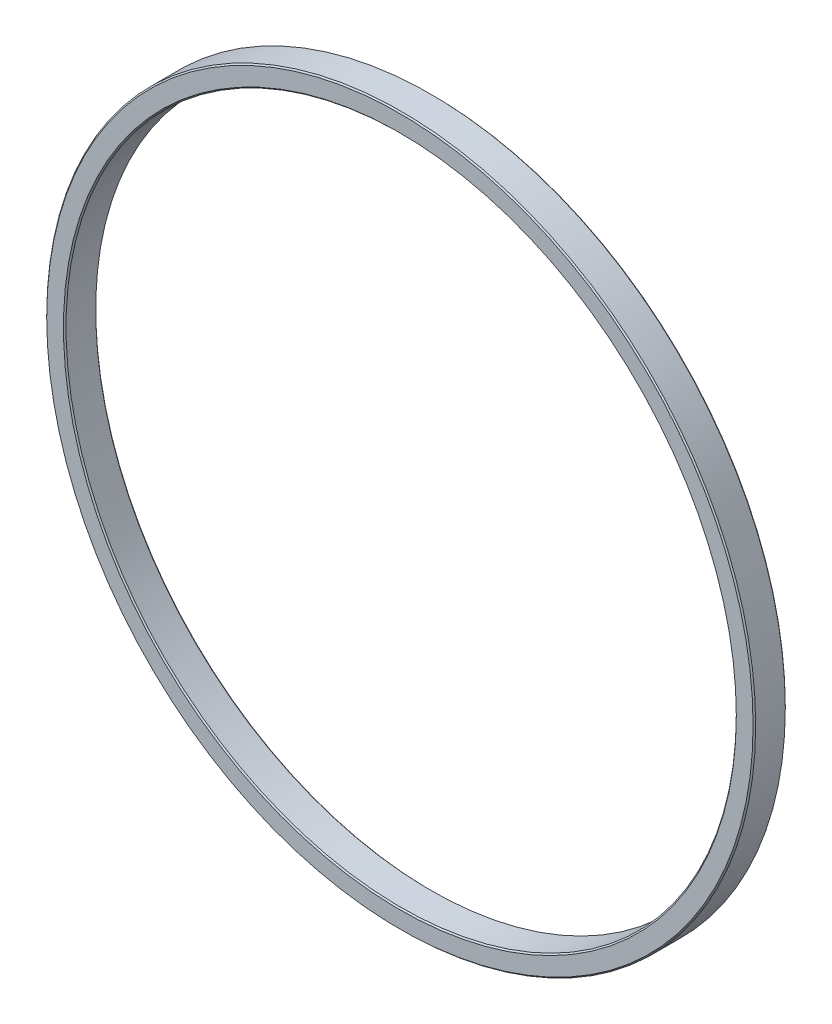
ISO-10303-21;
HEADER;
FILE_DESCRIPTION(('STEP AP214'),'2;1');
FILE_NAME('part.step','',(''),(''),'','','');
FILE_SCHEMA(('AUTOMOTIVE_DESIGN { 1 0 10303 214 1 1 1 1 }'));
ENDSEC;
DATA;
#1=APPLICATION_CONTEXT('core data for automotive mechanical design processes');
#2=APPLICATION_PROTOCOL_DEFINITION('international standard','automotive_design',2000,#1);
#3=PRODUCT_CONTEXT('',#1,'mechanical');
#4=PRODUCT('Part','Part','',(#3));
#5=PRODUCT_RELATED_PRODUCT_CATEGORY('part','',(#4));
#6=PRODUCT_DEFINITION_FORMATION('','',#4);
#7=PRODUCT_DEFINITION_CONTEXT('part definition',#1,'design');
#8=PRODUCT_DEFINITION('design','',#6,#7);
#9=PRODUCT_DEFINITION_SHAPE('','',#8);
#10=(LENGTH_UNIT() NAMED_UNIT(*) SI_UNIT(.MILLI.,.METRE.));
#11=(NAMED_UNIT(*) PLANE_ANGLE_UNIT() SI_UNIT($,.RADIAN.));
#12=(NAMED_UNIT(*) SI_UNIT($,.STERADIAN.) SOLID_ANGLE_UNIT());
#13=UNCERTAINTY_MEASURE_WITH_UNIT(LENGTH_MEASURE(1.E-05),#10,'distance_accuracy_value','');
#14=(GEOMETRIC_REPRESENTATION_CONTEXT(3) GLOBAL_UNCERTAINTY_ASSIGNED_CONTEXT((#13)) GLOBAL_UNIT_ASSIGNED_CONTEXT((#10,
#11,#12)) REPRESENTATION_CONTEXT('',''));
#15=CARTESIAN_POINT('',(0.,0.,0.));
#16=DIRECTION('',(0.,0.,1.));
#17=DIRECTION('',(1.,0.,0.));
#18=AXIS2_PLACEMENT_3D('',#15,#16,#17);
#19=CARTESIAN_POINT('',(0.,0.,5.));
#20=DIRECTION('',(0.,0.,1.));
#21=DIRECTION('',(1.,0.,0.));
#22=AXIS2_PLACEMENT_3D('',#19,#20,#21);
#23=PLANE('',#22);
#24=CARTESIAN_POINT('',(0.,0.,5.));
#25=DIRECTION('',(0.,0.,1.));
#26=DIRECTION('',(1.,0.,0.));
#27=AXIS2_PLACEMENT_3D('',#24,#25,#26);
#28=CIRCLE('',#27,52.2);
#29=CARTESIAN_POINT('',(52.2,0.,5.));
#30=VERTEX_POINT('',#29);
#31=EDGE_CURVE('E64',#30,#30,#28,.F.);
#32=ORIENTED_EDGE('',*,*,#31,.T.);
#33=EDGE_LOOP('',(#32));
#34=FACE_BOUND('',#33,.T.);
#35=CARTESIAN_POINT('',(0.,0.,5.));
#36=DIRECTION('',(0.,0.,1.));
#37=DIRECTION('',(1.,0.,0.));
#38=AXIS2_PLACEMENT_3D('',#35,#36,#37);
#39=CIRCLE('',#38,54.8);
#40=CARTESIAN_POINT('',(54.8,0.,5.));
#41=VERTEX_POINT('',#40);
#42=EDGE_CURVE('E68',#41,#41,#39,.T.);
#43=ORIENTED_EDGE('',*,*,#42,.T.);
#44=EDGE_LOOP('',(#43));
#45=FACE_BOUND('',#44,.T.);
#46=ADVANCED_FACE('F39',(#34,#45),#23,.T.);
#47=CARTESIAN_POINT('',(0.,0.,0.));
#48=DIRECTION('',(0.,0.,1.));
#49=DIRECTION('',(1.,0.,0.));
#50=AXIS2_PLACEMENT_3D('',#47,#48,#49);
#51=PLANE('',#50);
#52=CARTESIAN_POINT('',(0.,0.,0.));
#53=DIRECTION('',(0.,0.,1.));
#54=DIRECTION('',(1.,0.,0.));
#55=AXIS2_PLACEMENT_3D('',#52,#53,#54);
#56=CIRCLE('',#55,52.2);
#57=CARTESIAN_POINT('',(52.2,0.,0.));
#58=VERTEX_POINT('',#57);
#59=EDGE_CURVE('E10',#58,#58,#56,.T.);
#60=ORIENTED_EDGE('',*,*,#59,.T.);
#61=EDGE_LOOP('',(#60));
#62=FACE_BOUND('',#61,.T.);
#63=CARTESIAN_POINT('',(0.,0.,0.));
#64=DIRECTION('',(0.,0.,1.));
#65=DIRECTION('',(1.,0.,0.));
#66=AXIS2_PLACEMENT_3D('',#63,#64,#65);
#67=CIRCLE('',#66,54.8);
#68=CARTESIAN_POINT('',(54.8,0.,0.));
#69=VERTEX_POINT('',#68);
#70=EDGE_CURVE('E48',#69,#69,#67,.F.);
#71=ORIENTED_EDGE('',*,*,#70,.T.);
#72=EDGE_LOOP('',(#71));
#73=FACE_BOUND('',#72,.T.);
#74=ADVANCED_FACE('F97',(#62,#73),#51,.F.);
#75=CARTESIAN_POINT('',(0.,0.,5.));
#76=DIRECTION('',(0.,0.,-1.));
#77=DIRECTION('',(-1.,0.,0.));
#78=AXIS2_PLACEMENT_3D('',#75,#76,#77);
#79=CYLINDRICAL_SURFACE('',#78,55.);
#80=CARTESIAN_POINT('',(0.,0.,4.80000000000001));
#81=DIRECTION('',(0.,0.,1.));
#82=DIRECTION('',(1.,0.,0.));
#83=AXIS2_PLACEMENT_3D('',#80,#81,#82);
#84=CIRCLE('',#83,55.);
#85=CARTESIAN_POINT('',(55.,0.,4.80000000000001));
#86=VERTEX_POINT('',#85);
#87=EDGE_CURVE('E53',#86,#86,#84,.F.);
#88=ORIENTED_EDGE('',*,*,#87,.T.);
#89=EDGE_LOOP('',(#88));
#90=FACE_BOUND('',#89,.T.);
#91=CARTESIAN_POINT('',(0.,0.,0.199999999999999));
#92=DIRECTION('',(0.,0.,1.));
#93=DIRECTION('',(1.,0.,0.));
#94=AXIS2_PLACEMENT_3D('',#91,#92,#93);
#95=CIRCLE('',#94,55.);
#96=CARTESIAN_POINT('',(55.,0.,0.199999999999999));
#97=VERTEX_POINT('',#96);
#98=EDGE_CURVE('E58',#97,#97,#95,.T.);
#99=ORIENTED_EDGE('',*,*,#98,.T.);
#100=EDGE_LOOP('',(#99));
#101=FACE_BOUND('',#100,.T.);
#102=ADVANCED_FACE('F103',(#90,#101),#79,.T.);
#103=CARTESIAN_POINT('',(0.,0.,5.));
#104=DIRECTION('',(0.,0.,-1.));
#105=DIRECTION('',(-1.,0.,0.));
#106=AXIS2_PLACEMENT_3D('',#103,#104,#105);
#107=CYLINDRICAL_SURFACE('',#106,52.);
#108=CARTESIAN_POINT('',(0.,0.,4.80000000000001));
#109=DIRECTION('',(0.,0.,1.));
#110=DIRECTION('',(1.,0.,0.));
#111=AXIS2_PLACEMENT_3D('',#108,#109,#110);
#112=CIRCLE('',#111,52.);
#113=CARTESIAN_POINT('',(52.,0.,4.80000000000001));
#114=VERTEX_POINT('',#113);
#115=EDGE_CURVE('E72',#114,#114,#112,.T.);
#116=ORIENTED_EDGE('',*,*,#115,.T.);
#117=EDGE_LOOP('',(#116));
#118=FACE_BOUND('',#117,.T.);
#119=CARTESIAN_POINT('',(0.,0.,0.199999999999978));
#120=DIRECTION('',(0.,0.,1.));
#121=DIRECTION('',(1.,0.,0.));
#122=AXIS2_PLACEMENT_3D('',#119,#120,#121);
#123=CIRCLE('',#122,52.);
#124=CARTESIAN_POINT('',(52.,0.,0.199999999999978));
#125=VERTEX_POINT('',#124);
#126=EDGE_CURVE('E76',#125,#125,#123,.F.);
#127=ORIENTED_EDGE('',*,*,#126,.T.);
#128=EDGE_LOOP('',(#127));
#129=FACE_BOUND('',#128,.T.);
#130=ADVANCED_FACE('F81',(#118,#129),#107,.F.);
#131=CARTESIAN_POINT('',(0.,0.,4.80000000000001));
#132=DIRECTION('',(0.,0.,1.));
#133=DIRECTION('',(1.,0.,0.));
#134=AXIS2_PLACEMENT_3D('',#131,#132,#133);
#135=CONICAL_SURFACE('',#134,52.,0.785398163397448);
#136=ORIENTED_EDGE('',*,*,#31,.F.);
#137=EDGE_LOOP('',(#136));
#138=FACE_BOUND('',#137,.T.);
#139=ORIENTED_EDGE('',*,*,#115,.F.);
#140=EDGE_LOOP('',(#139));
#141=FACE_BOUND('',#140,.T.);
#142=ADVANCED_FACE('F92',(#138,#141),#135,.F.);
#143=CARTESIAN_POINT('',(0.,0.,5.));
#144=DIRECTION('',(0.,0.,-1.));
#145=DIRECTION('',(-1.,0.,0.));
#146=AXIS2_PLACEMENT_3D('',#143,#144,#145);
#147=CONICAL_SURFACE('',#146,54.8,0.785398163397431);
#148=ORIENTED_EDGE('',*,*,#87,.F.);
#149=EDGE_LOOP('',(#148));
#150=FACE_BOUND('',#149,.T.);
#151=ORIENTED_EDGE('',*,*,#42,.F.);
#152=EDGE_LOOP('',(#151));
#153=FACE_BOUND('',#152,.T.);
#154=ADVANCED_FACE('F86',(#150,#153),#147,.T.);
#155=CARTESIAN_POINT('',(0.,0.,0.));
#156=DIRECTION('',(0.,0.,-1.));
#157=DIRECTION('',(-1.,0.,0.));
#158=AXIS2_PLACEMENT_3D('',#155,#156,#157);
#159=CONICAL_SURFACE('',#158,52.2,0.785398163397483);
#160=ORIENTED_EDGE('',*,*,#126,.F.);
#161=EDGE_LOOP('',(#160));
#162=FACE_BOUND('',#161,.T.);
#163=ORIENTED_EDGE('',*,*,#59,.F.);
#164=EDGE_LOOP('',(#163));
#165=FACE_BOUND('',#164,.T.);
#166=ADVANCED_FACE('F83',(#162,#165),#159,.F.);
#167=CARTESIAN_POINT('',(0.,0.,0.199999999999999));
#168=DIRECTION('',(0.,0.,1.));
#169=DIRECTION('',(1.,0.,0.));
#170=AXIS2_PLACEMENT_3D('',#167,#168,#169);
#171=CONICAL_SURFACE('',#170,55.,0.785398163397414);
#172=ORIENTED_EDGE('',*,*,#70,.F.);
#173=EDGE_LOOP('',(#172));
#174=FACE_BOUND('',#173,.T.);
#175=ORIENTED_EDGE('',*,*,#98,.F.);
#176=EDGE_LOOP('',(#175));
#177=FACE_BOUND('',#176,.T.);
#178=ADVANCED_FACE('F42',(#174,#177),#171,.T.);
#179=CLOSED_SHELL('',(#46,#74,#102,#130,#142,#154,#166,#178));
#180=MANIFOLD_SOLID_BREP('B2',#179);
#181=ADVANCED_BREP_SHAPE_REPRESENTATION('',(#18,#180),#14);
#182=SHAPE_DEFINITION_REPRESENTATION(#9,#181);
ENDSEC;
END-ISO-10303-21;
